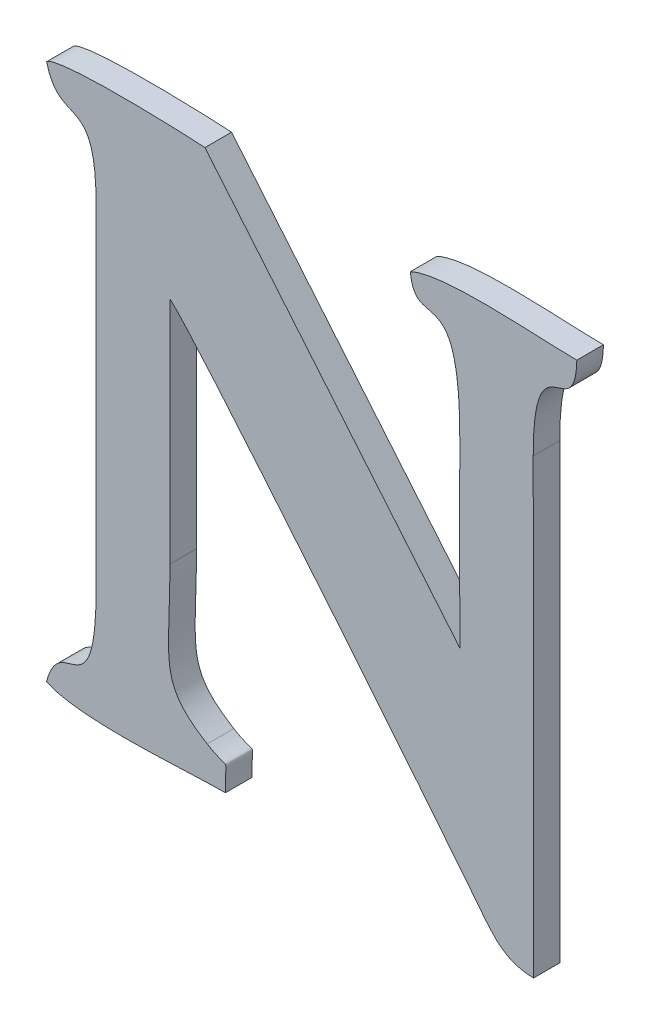
ISO-10303-21;
HEADER;
FILE_DESCRIPTION(('STEP AP214'),'2;1');
FILE_NAME('part.step','',(''),(''),'','','');
FILE_SCHEMA(('AUTOMOTIVE_DESIGN { 1 0 10303 214 1 1 1 1 }'));
ENDSEC;
DATA;
#1=APPLICATION_CONTEXT('core data for automotive mechanical design processes');
#2=APPLICATION_PROTOCOL_DEFINITION('international standard','automotive_design',2000,#1);
#3=PRODUCT_CONTEXT('',#1,'mechanical');
#4=PRODUCT('Part','Part','',(#3));
#5=PRODUCT_RELATED_PRODUCT_CATEGORY('part','',(#4));
#6=PRODUCT_DEFINITION_FORMATION('','',#4);
#7=PRODUCT_DEFINITION_CONTEXT('part definition',#1,'design');
#8=PRODUCT_DEFINITION('design','',#6,#7);
#9=PRODUCT_DEFINITION_SHAPE('','',#8);
#10=(LENGTH_UNIT() NAMED_UNIT(*) SI_UNIT(.MILLI.,.METRE.));
#11=(NAMED_UNIT(*) PLANE_ANGLE_UNIT() SI_UNIT($,.RADIAN.));
#12=(NAMED_UNIT(*) SI_UNIT($,.STERADIAN.) SOLID_ANGLE_UNIT());
#13=UNCERTAINTY_MEASURE_WITH_UNIT(LENGTH_MEASURE(1.E-05),#10,'distance_accuracy_value','');
#14=(GEOMETRIC_REPRESENTATION_CONTEXT(3) GLOBAL_UNCERTAINTY_ASSIGNED_CONTEXT((#13)) GLOBAL_UNIT_ASSIGNED_CONTEXT((#10,
#11,#12)) REPRESENTATION_CONTEXT('',''));
#15=CARTESIAN_POINT('',(0.,0.,0.));
#16=DIRECTION('',(0.,0.,1.));
#17=DIRECTION('',(1.,0.,0.));
#18=AXIS2_PLACEMENT_3D('',#15,#16,#17);
#19=CARTESIAN_POINT('',(35.1119117688146,29.2527985991207,0.001));
#20=DIRECTION('',(-0.768297979617838,-0.640092348427278,0.));
#21=DIRECTION('',(0.640092348427278,-0.768297979617838,0.));
#22=AXIS2_PLACEMENT_3D('',#19,#20,#21);
#23=PLANE('',#22);
#24=DIRECTION('',(-0.640092348427278,0.768297979617838,0.));
#25=VECTOR('',#24,1.);
#26=CARTESIAN_POINT('',(35.1119117688146,29.2527985991207,0.));
#27=LINE('',#26,#25);
#28=CARTESIAN_POINT('',(50.1452799999998,11.208361,0.));
#29=VERTEX_POINT('',#28);
#30=CARTESIAN_POINT('',(50.1357039999998,11.219855,0.));
#31=VERTEX_POINT('',#30);
#32=EDGE_CURVE('E11',#29,#31,#27,.T.);
#33=ORIENTED_EDGE('',*,*,#32,.T.);
#34=DIRECTION('',(0.,0.,-1.));
#35=VECTOR('',#34,1.);
#36=CARTESIAN_POINT('',(50.1357039999998,11.219855,0.001));
#37=LINE('',#36,#35);
#38=CARTESIAN_POINT('',(50.1357039999998,11.219855,0.001));
#39=VERTEX_POINT('',#38);
#40=EDGE_CURVE('E24',#39,#31,#37,.T.);
#41=ORIENTED_EDGE('',*,*,#40,.F.);
#42=DIRECTION('',(-0.640092348427278,0.768297979617838,0.));
#43=VECTOR('',#42,1.);
#44=CARTESIAN_POINT('',(35.1119117688146,29.2527985991207,0.001));
#45=LINE('',#44,#43);
#46=CARTESIAN_POINT('',(50.1452799999998,11.208361,0.001));
#47=VERTEX_POINT('',#46);
#48=EDGE_CURVE('E367',#47,#39,#45,.T.);
#49=ORIENTED_EDGE('',*,*,#48,.F.);
#50=DIRECTION('',(0.,0.,-1.));
#51=VECTOR('',#50,1.);
#52=CARTESIAN_POINT('',(50.1452799999998,11.208361,0.001));
#53=LINE('',#52,#51);
#54=EDGE_CURVE('E148',#47,#29,#53,.T.);
#55=ORIENTED_EDGE('',*,*,#54,.T.);
#56=EDGE_LOOP('',(#33,#41,#49,#55));
#57=FACE_BOUND('',#56,.T.);
#58=ADVANCED_FACE('F17',(#57),#23,.F.);
#59=CARTESIAN_POINT('',(50.1357039999998,11.219855,0.001));
#60=CARTESIAN_POINT('',(50.1357039999998,11.219855,0.));
#61=CARTESIAN_POINT('',(50.1347799999998,11.219925,0.001));
#62=CARTESIAN_POINT('',(50.1347799999998,11.219925,0.));
#63=CARTESIAN_POINT('',(50.1301879999998,11.220093,0.001));
#64=CARTESIAN_POINT('',(50.1301879999998,11.220093,0.));
#65=CARTESIAN_POINT('',(50.1297539999998,11.219673,0.001));
#66=CARTESIAN_POINT('',(50.1297539999998,11.219673,0.));
#67=B_SPLINE_SURFACE_WITH_KNOTS('',3,1,((#59,#60),(#61,#62),(#63,#64),(#65,#66)),.UNSPECIFIED.,
.F.,.F.,.F.,(4,4),(2,2),(0.882352941176471,1.),(0.,1.),.UNSPECIFIED.);
#68=CARTESIAN_POINT('',(50.1357039999998,11.219855,0.));
#69=CARTESIAN_POINT('',(50.1347799999998,11.219925,0.));
#70=CARTESIAN_POINT('',(50.1301879999998,11.220093,0.));
#71=CARTESIAN_POINT('',(50.1297539999998,11.219673,0.));
#72=B_SPLINE_CURVE_WITH_KNOTS('',3,(#68,#69,#70,#71),.UNSPECIFIED.,.F.,.F.,(4,4),
(0.882352941176471,1.),.UNSPECIFIED.);
#73=CARTESIAN_POINT('',(50.1297539999998,11.219673,0.));
#74=VERTEX_POINT('',#73);
#75=EDGE_CURVE('E358',#31,#74,#72,.T.);
#76=DIRECTION('',(0.,0.,-1.));
#77=VECTOR('',#76,1.);
#78=CARTESIAN_POINT('',(50.1297539999998,11.219673,0.001));
#79=LINE('',#78,#77);
#80=CARTESIAN_POINT('',(50.1297539999998,11.219673,0.001));
#81=VERTEX_POINT('',#80);
#82=EDGE_CURVE('E353',#81,#74,#79,.T.);
#83=CARTESIAN_POINT('',(50.1357039999998,11.219855,0.001));
#84=CARTESIAN_POINT('',(50.1347799999998,11.219925,0.001));
#85=CARTESIAN_POINT('',(50.1301879999998,11.220093,0.001));
#86=CARTESIAN_POINT('',(50.1297539999998,11.219673,0.001));
#87=B_SPLINE_CURVE_WITH_KNOTS('',3,(#83,#84,#85,#86),.UNSPECIFIED.,.F.,.F.,(4,4),
(0.882352941176471,1.),.UNSPECIFIED.);
#88=EDGE_CURVE('E346',#39,#81,#87,.T.);
#89=ORIENTED_EDGE('',*,*,#75,.T.);
#90=ORIENTED_EDGE('',*,*,#82,.F.);
#91=ORIENTED_EDGE('',*,*,#88,.F.);
#92=ORIENTED_EDGE('',*,*,#40,.T.);
#93=EDGE_LOOP('',(#89,#90,#91,#92));
#94=FACE_BOUND('',#93,.T.);
#95=ADVANCED_FACE('F370',(#94),#67,.F.);
#96=CARTESIAN_POINT('',(50.1297539999998,11.219673,0.001));
#97=CARTESIAN_POINT('',(50.1297539999998,11.219673,0.));
#98=CARTESIAN_POINT('',(50.1302719999998,11.217685,0.001));
#99=CARTESIAN_POINT('',(50.1302719999998,11.217685,0.));
#100=CARTESIAN_POINT('',(50.1316579999998,11.219715,0.001));
#101=CARTESIAN_POINT('',(50.1316579999998,11.219715,0.));
#102=CARTESIAN_POINT('',(50.1316159999998,11.215753,0.001));
#103=CARTESIAN_POINT('',(50.1316159999998,11.215753,0.));
#104=B_SPLINE_SURFACE_WITH_KNOTS('',3,1,((#96,#97),(#98,#99),(#100,#101),(#102,#103)),
.UNSPECIFIED.,.F.,.F.,.F.,(4,4),(2,2),(0.,0.0588235294117647),(0.,1.),.UNSPECIFIED.);
#105=CARTESIAN_POINT('',(50.1297539999998,11.219673,0.));
#106=CARTESIAN_POINT('',(50.1302719999998,11.217685,0.));
#107=CARTESIAN_POINT('',(50.1316579999998,11.219715,0.));
#108=CARTESIAN_POINT('',(50.1316159999998,11.215753,0.));
#109=B_SPLINE_CURVE_WITH_KNOTS('',3,(#105,#106,#107,#108),.UNSPECIFIED.,.F.,.F.,(4,4),(0.,
0.0588235294117647),.UNSPECIFIED.);
#110=CARTESIAN_POINT('',(50.1316159999998,11.215753,0.));
#111=VERTEX_POINT('',#110);
#112=EDGE_CURVE('E341',#74,#111,#109,.T.);
#113=DIRECTION('',(0.,0.,-1.));
#114=VECTOR('',#113,1.);
#115=CARTESIAN_POINT('',(50.1316159999998,11.215753,0.001));
#116=LINE('',#115,#114);
#117=CARTESIAN_POINT('',(50.1316159999998,11.215753,0.001));
#118=VERTEX_POINT('',#117);
#119=EDGE_CURVE('E336',#118,#111,#116,.T.);
#120=CARTESIAN_POINT('',(50.1297539999998,11.219673,0.001));
#121=CARTESIAN_POINT('',(50.1302719999998,11.217685,0.001));
#122=CARTESIAN_POINT('',(50.1316579999998,11.219715,0.001));
#123=CARTESIAN_POINT('',(50.1316159999998,11.215753,0.001));
#124=B_SPLINE_CURVE_WITH_KNOTS('',3,(#120,#121,#122,#123),.UNSPECIFIED.,.F.,.F.,(4,4),(0.,
0.0588235294117647),.UNSPECIFIED.);
#125=EDGE_CURVE('E332',#81,#118,#124,.T.);
#126=ORIENTED_EDGE('',*,*,#112,.T.);
#127=ORIENTED_EDGE('',*,*,#119,.F.);
#128=ORIENTED_EDGE('',*,*,#125,.F.);
#129=ORIENTED_EDGE('',*,*,#82,.T.);
#130=EDGE_LOOP('',(#126,#127,#128,#129));
#131=FACE_BOUND('',#130,.T.);
#132=ADVANCED_FACE('F378',(#131),#104,.F.);
#133=CARTESIAN_POINT('',(50.1316159999998,0.,0.001));
#134=DIRECTION('',(1.,0.,0.));
#135=DIRECTION('',(0.,0.,-1.));
#136=AXIS2_PLACEMENT_3D('',#133,#134,#135);
#137=PLANE('',#136);
#138=DIRECTION('',(0.,-1.,0.));
#139=VECTOR('',#138,1.);
#140=CARTESIAN_POINT('',(50.1316159999998,0.,0.));
#141=LINE('',#140,#139);
#142=CARTESIAN_POINT('',(50.1316159999998,11.203671,0.));
#143=VERTEX_POINT('',#142);
#144=EDGE_CURVE('E330',#111,#143,#141,.T.);
#145=ORIENTED_EDGE('',*,*,#144,.T.);
#146=DIRECTION('',(0.,0.,-1.));
#147=VECTOR('',#146,1.);
#148=CARTESIAN_POINT('',(50.1316159999998,11.203671,0.001));
#149=LINE('',#148,#147);
#150=CARTESIAN_POINT('',(50.1316159999998,11.203671,0.001));
#151=VERTEX_POINT('',#150);
#152=EDGE_CURVE('E327',#151,#143,#149,.T.);
#153=ORIENTED_EDGE('',*,*,#152,.F.);
#154=DIRECTION('',(0.,-1.,0.));
#155=VECTOR('',#154,1.);
#156=CARTESIAN_POINT('',(50.1316159999998,0.,0.001));
#157=LINE('',#156,#155);
#158=EDGE_CURVE('E321',#118,#151,#157,.T.);
#159=ORIENTED_EDGE('',*,*,#158,.F.);
#160=ORIENTED_EDGE('',*,*,#119,.T.);
#161=EDGE_LOOP('',(#145,#153,#159,#160));
#162=FACE_BOUND('',#161,.T.);
#163=ADVANCED_FACE('F427',(#162),#137,.F.);
#164=CARTESIAN_POINT('',(50.1316159999998,11.203671,0.001));
#165=CARTESIAN_POINT('',(50.1316159999998,11.203671,0.));
#166=CARTESIAN_POINT('',(50.1316579999998,11.198995,0.001));
#167=CARTESIAN_POINT('',(50.1316579999998,11.198995,0.));
#168=CARTESIAN_POINT('',(50.1302999999998,11.201613,0.001));
#169=CARTESIAN_POINT('',(50.1302999999998,11.201613,0.));
#170=CARTESIAN_POINT('',(50.1297539999998,11.199499,0.001));
#171=CARTESIAN_POINT('',(50.1297539999998,11.199499,0.));
#172=B_SPLINE_SURFACE_WITH_KNOTS('',3,1,((#164,#165),(#166,#167),(#168,#169),(#170,#171)),
.UNSPECIFIED.,.F.,.F.,.F.,(4,4),(2,2),(0.117647058823529,0.176470588235294),(0.,1.),.UNSPECIFIED.);
#173=CARTESIAN_POINT('',(50.1316159999998,11.203671,0.));
#174=CARTESIAN_POINT('',(50.1316579999998,11.198995,0.));
#175=CARTESIAN_POINT('',(50.1302999999998,11.201613,0.));
#176=CARTESIAN_POINT('',(50.1297539999998,11.199499,0.));
#177=B_SPLINE_CURVE_WITH_KNOTS('',3,(#173,#174,#175,#176),.UNSPECIFIED.,.F.,.F.,(4,4),
(0.117647058823529,0.176470588235294),.UNSPECIFIED.);
#178=CARTESIAN_POINT('',(50.1297539999998,11.199499,0.));
#179=VERTEX_POINT('',#178);
#180=EDGE_CURVE('E316',#143,#179,#177,.T.);
#181=DIRECTION('',(0.,0.,-1.));
#182=VECTOR('',#181,1.);
#183=CARTESIAN_POINT('',(50.1297539999998,11.199499,0.001));
#184=LINE('',#183,#182);
#185=CARTESIAN_POINT('',(50.1297539999998,11.199499,0.001));
#186=VERTEX_POINT('',#185);
#187=EDGE_CURVE('E311',#186,#179,#184,.T.);
#188=CARTESIAN_POINT('',(50.1316159999998,11.203671,0.001));
#189=CARTESIAN_POINT('',(50.1316579999998,11.198995,0.001));
#190=CARTESIAN_POINT('',(50.1302999999998,11.201613,0.001));
#191=CARTESIAN_POINT('',(50.1297539999998,11.199499,0.001));
#192=B_SPLINE_CURVE_WITH_KNOTS('',3,(#188,#189,#190,#191),.UNSPECIFIED.,.F.,.F.,(4,4),
(0.117647058823529,0.176470588235294),.UNSPECIFIED.);
#193=EDGE_CURVE('E304',#151,#186,#192,.T.);
#194=ORIENTED_EDGE('',*,*,#180,.T.);
#195=ORIENTED_EDGE('',*,*,#187,.F.);
#196=ORIENTED_EDGE('',*,*,#193,.F.);
#197=ORIENTED_EDGE('',*,*,#152,.T.);
#198=EDGE_LOOP('',(#194,#195,#196,#197));
#199=FACE_BOUND('',#198,.T.);
#200=ADVANCED_FACE('F425',(#199),#172,.F.);
#201=CARTESIAN_POINT('',(50.1297539999998,11.199499,0.001));
#202=CARTESIAN_POINT('',(50.1297539999998,11.199499,0.));
#203=CARTESIAN_POINT('',(50.1310279999998,11.198883,0.001));
#204=CARTESIAN_POINT('',(50.1310279999998,11.198883,0.));
#205=CARTESIAN_POINT('',(50.1348639999998,11.199247,0.001));
#206=CARTESIAN_POINT('',(50.1348639999998,11.199247,0.));
#207=CARTESIAN_POINT('',(50.1364739999998,11.199247,0.001));
#208=CARTESIAN_POINT('',(50.1364739999998,11.199247,0.));
#209=B_SPLINE_SURFACE_WITH_KNOTS('',3,1,((#201,#202),(#203,#204),(#205,#206),(#207,#208)),
.UNSPECIFIED.,.F.,.F.,.F.,(4,4),(2,2),(0.176470588235294,0.235294117647059),(0.,1.),.UNSPECIFIED.);
#210=CARTESIAN_POINT('',(50.1297539999998,11.199499,0.));
#211=CARTESIAN_POINT('',(50.1310279999998,11.198883,0.));
#212=CARTESIAN_POINT('',(50.1348639999998,11.199247,0.));
#213=CARTESIAN_POINT('',(50.1364739999998,11.199247,0.));
#214=B_SPLINE_CURVE_WITH_KNOTS('',3,(#210,#211,#212,#213),.UNSPECIFIED.,.F.,.F.,(4,4),
(0.176470588235294,0.235294117647059),.UNSPECIFIED.);
#215=CARTESIAN_POINT('',(50.1364739999998,11.199247,0.));
#216=VERTEX_POINT('',#215);
#217=EDGE_CURVE('E299',#179,#216,#214,.T.);
#218=DIRECTION('',(0.,0.,-1.));
#219=VECTOR('',#218,1.);
#220=CARTESIAN_POINT('',(50.1364739999998,11.199247,0.001));
#221=LINE('',#220,#219);
#222=CARTESIAN_POINT('',(50.1364739999998,11.199247,0.001));
#223=VERTEX_POINT('',#222);
#224=EDGE_CURVE('E294',#223,#216,#221,.T.);
#225=CARTESIAN_POINT('',(50.1297539999998,11.199499,0.001));
#226=CARTESIAN_POINT('',(50.1310279999998,11.198883,0.001));
#227=CARTESIAN_POINT('',(50.1348639999998,11.199247,0.001));
#228=CARTESIAN_POINT('',(50.1364739999998,11.199247,0.001));
#229=B_SPLINE_CURVE_WITH_KNOTS('',3,(#225,#226,#227,#228),.UNSPECIFIED.,.F.,.F.,(4,4),
(0.176470588235294,0.235294117647059),.UNSPECIFIED.);
#230=EDGE_CURVE('E287',#186,#223,#229,.T.);
#231=ORIENTED_EDGE('',*,*,#217,.T.);
#232=ORIENTED_EDGE('',*,*,#224,.F.);
#233=ORIENTED_EDGE('',*,*,#230,.F.);
#234=ORIENTED_EDGE('',*,*,#187,.T.);
#235=EDGE_LOOP('',(#231,#232,#233,#234));
#236=FACE_BOUND('',#235,.T.);
#237=ADVANCED_FACE('F422',(#236),#209,.F.);
#238=CARTESIAN_POINT('',(50.1364739999998,11.199247,0.001));
#239=CARTESIAN_POINT('',(50.1364739999998,11.199247,0.));
#240=CARTESIAN_POINT('',(50.1364459999998,11.200605,0.001));
#241=CARTESIAN_POINT('',(50.1364459999998,11.200605,0.));
#242=CARTESIAN_POINT('',(50.1367399999998,11.199919,0.001));
#243=CARTESIAN_POINT('',(50.1367399999998,11.199919,0.));
#244=CARTESIAN_POINT('',(50.1357879999998,11.200493,0.001));
#245=CARTESIAN_POINT('',(50.1357879999998,11.200493,0.));
#246=B_SPLINE_SURFACE_WITH_KNOTS('',3,1,((#238,#239),(#240,#241),(#242,#243),(#244,#245)),
.UNSPECIFIED.,.F.,.F.,.F.,(4,4),(2,2),(0.235294117647059,0.294117647058823),(0.,1.),.UNSPECIFIED.);
#247=CARTESIAN_POINT('',(50.1364739999998,11.199247,0.));
#248=CARTESIAN_POINT('',(50.1364459999998,11.200605,0.));
#249=CARTESIAN_POINT('',(50.1367399999998,11.199919,0.));
#250=CARTESIAN_POINT('',(50.1357879999998,11.200493,0.));
#251=B_SPLINE_CURVE_WITH_KNOTS('',3,(#247,#248,#249,#250),.UNSPECIFIED.,.F.,.F.,(4,4),
(0.235294117647059,0.294117647058823),.UNSPECIFIED.);
#252=CARTESIAN_POINT('',(50.1357879999998,11.200493,0.));
#253=VERTEX_POINT('',#252);
#254=EDGE_CURVE('E282',#216,#253,#251,.T.);
#255=DIRECTION('',(0.,0.,-1.));
#256=VECTOR('',#255,1.);
#257=CARTESIAN_POINT('',(50.1357879999998,11.200493,0.001));
#258=LINE('',#257,#256);
#259=CARTESIAN_POINT('',(50.1357879999998,11.200493,0.001));
#260=VERTEX_POINT('',#259);
#261=EDGE_CURVE('E277',#260,#253,#258,.T.);
#262=CARTESIAN_POINT('',(50.1364739999998,11.199247,0.001));
#263=CARTESIAN_POINT('',(50.1364459999998,11.200605,0.001));
#264=CARTESIAN_POINT('',(50.1367399999998,11.199919,0.001));
#265=CARTESIAN_POINT('',(50.1357879999998,11.200493,0.001));
#266=B_SPLINE_CURVE_WITH_KNOTS('',3,(#262,#263,#264,#265),.UNSPECIFIED.,.F.,.F.,(4,4),
(0.235294117647059,0.294117647058823),.UNSPECIFIED.);
#267=EDGE_CURVE('E270',#223,#260,#266,.T.);
#268=ORIENTED_EDGE('',*,*,#254,.T.);
#269=ORIENTED_EDGE('',*,*,#261,.F.);
#270=ORIENTED_EDGE('',*,*,#267,.F.);
#271=ORIENTED_EDGE('',*,*,#224,.T.);
#272=EDGE_LOOP('',(#268,#269,#270,#271));
#273=FACE_BOUND('',#272,.T.);
#274=ADVANCED_FACE('F418',(#273),#246,.F.);
#275=CARTESIAN_POINT('',(50.1357879999998,11.200493,0.001));
#276=CARTESIAN_POINT('',(50.1357879999998,11.200493,0.));
#277=CARTESIAN_POINT('',(50.1339119999998,11.201641,0.001));
#278=CARTESIAN_POINT('',(50.1339119999998,11.201641,0.));
#279=CARTESIAN_POINT('',(50.1343879999998,11.202425,0.001));
#280=CARTESIAN_POINT('',(50.1343879999998,11.202425,0.));
#281=CARTESIAN_POINT('',(50.1343879999998,11.205645,0.001));
#282=CARTESIAN_POINT('',(50.1343879999998,11.205645,0.));
#283=B_SPLINE_SURFACE_WITH_KNOTS('',3,1,((#275,#276),(#277,#278),(#279,#280),(#281,#282)),
.UNSPECIFIED.,.F.,.F.,.F.,(4,4),(2,2),(0.294117647058823,0.352941176470588),(0.,1.),.UNSPECIFIED.);
#284=CARTESIAN_POINT('',(50.1357879999998,11.200493,0.));
#285=CARTESIAN_POINT('',(50.1339119999998,11.201641,0.));
#286=CARTESIAN_POINT('',(50.1343879999998,11.202425,0.));
#287=CARTESIAN_POINT('',(50.1343879999998,11.205645,0.));
#288=B_SPLINE_CURVE_WITH_KNOTS('',3,(#284,#285,#286,#287),.UNSPECIFIED.,.F.,.F.,(4,4),
(0.294117647058823,0.352941176470588),.UNSPECIFIED.);
#289=CARTESIAN_POINT('',(50.1343879999998,11.205645,0.));
#290=VERTEX_POINT('',#289);
#291=EDGE_CURVE('E265',#253,#290,#288,.T.);
#292=DIRECTION('',(0.,0.,-1.));
#293=VECTOR('',#292,1.);
#294=CARTESIAN_POINT('',(50.1343879999998,11.205645,0.001));
#295=LINE('',#294,#293);
#296=CARTESIAN_POINT('',(50.1343879999998,11.205645,0.001));
#297=VERTEX_POINT('',#296);
#298=EDGE_CURVE('E260',#297,#290,#295,.T.);
#299=CARTESIAN_POINT('',(50.1357879999998,11.200493,0.001));
#300=CARTESIAN_POINT('',(50.1339119999998,11.201641,0.001));
#301=CARTESIAN_POINT('',(50.1343879999998,11.202425,0.001));
#302=CARTESIAN_POINT('',(50.1343879999998,11.205645,0.001));
#303=B_SPLINE_CURVE_WITH_KNOTS('',3,(#299,#300,#301,#302),.UNSPECIFIED.,.F.,.F.,(4,4),
(0.294117647058823,0.352941176470588),.UNSPECIFIED.);
#304=EDGE_CURVE('E256',#260,#297,#303,.T.);
#305=ORIENTED_EDGE('',*,*,#291,.T.);
#306=ORIENTED_EDGE('',*,*,#298,.F.);
#307=ORIENTED_EDGE('',*,*,#304,.F.);
#308=ORIENTED_EDGE('',*,*,#261,.T.);
#309=EDGE_LOOP('',(#305,#306,#307,#308));
#310=FACE_BOUND('',#309,.T.);
#311=ADVANCED_FACE('F414',(#310),#283,.F.);
#312=CARTESIAN_POINT('',(50.1343879999998,0.,0.001));
#313=DIRECTION('',(-1.,0.,0.));
#314=DIRECTION('',(0.,0.,1.));
#315=AXIS2_PLACEMENT_3D('',#312,#313,#314);
#316=PLANE('',#315);
#317=DIRECTION('',(0.,1.,0.));
#318=VECTOR('',#317,1.);
#319=CARTESIAN_POINT('',(50.1343879999998,0.,0.));
#320=LINE('',#319,#318);
#321=CARTESIAN_POINT('',(50.1343879999998,11.214269,0.));
#322=VERTEX_POINT('',#321);
#323=EDGE_CURVE('E254',#290,#322,#320,.T.);
#324=ORIENTED_EDGE('',*,*,#323,.T.);
#325=DIRECTION('',(0.,0.,-1.));
#326=VECTOR('',#325,1.);
#327=CARTESIAN_POINT('',(50.1343879999998,11.214269,0.001));
#328=LINE('',#327,#326);
#329=CARTESIAN_POINT('',(50.1343879999998,11.214269,0.001));
#330=VERTEX_POINT('',#329);
#331=EDGE_CURVE('E251',#330,#322,#328,.T.);
#332=ORIENTED_EDGE('',*,*,#331,.F.);
#333=DIRECTION('',(0.,1.,0.));
#334=VECTOR('',#333,1.);
#335=CARTESIAN_POINT('',(50.1343879999998,0.,0.001));
#336=LINE('',#335,#334);
#337=EDGE_CURVE('E245',#297,#330,#336,.T.);
#338=ORIENTED_EDGE('',*,*,#337,.F.);
#339=ORIENTED_EDGE('',*,*,#298,.T.);
#340=EDGE_LOOP('',(#324,#332,#338,#339));
#341=FACE_BOUND('',#340,.T.);
#342=ADVANCED_FACE('F408',(#341),#316,.F.);
#343=CARTESIAN_POINT('',(50.1343879999998,11.214269,0.000999999999999998));
#344=CARTESIAN_POINT('',(50.1343879999998,11.214269,0.));
#345=CARTESIAN_POINT('',(50.1351579999998,11.213723,0.000999999999999998));
#346=CARTESIAN_POINT('',(50.1351579999998,11.213723,0.));
#347=CARTESIAN_POINT('',(50.1439359999998,11.202943,0.000999999999999998));
#348=CARTESIAN_POINT('',(50.1439359999998,11.202943,0.));
#349=CARTESIAN_POINT('',(50.1458119999998,11.200549,0.000999999999999998));
#350=CARTESIAN_POINT('',(50.1458119999998,11.200549,0.));
#351=B_SPLINE_SURFACE_WITH_KNOTS('',3,1,((#343,#344),(#345,#346),(#347,#348),(#349,#350)),
.UNSPECIFIED.,.F.,.F.,.F.,(4,4),(2,2),(0.411764705882353,0.470588235294118),(0.,1.),.UNSPECIFIED.);
#352=CARTESIAN_POINT('',(50.1343879999998,11.214269,0.));
#353=CARTESIAN_POINT('',(50.1351579999998,11.213723,0.));
#354=CARTESIAN_POINT('',(50.1439359999998,11.202943,0.));
#355=CARTESIAN_POINT('',(50.1458119999998,11.200549,0.));
#356=B_SPLINE_CURVE_WITH_KNOTS('',3,(#352,#353,#354,#355),.UNSPECIFIED.,.F.,.F.,(4,4),
(0.411764705882353,0.470588235294118),.UNSPECIFIED.);
#357=CARTESIAN_POINT('',(50.1458119999998,11.200549,0.));
#358=VERTEX_POINT('',#357);
#359=EDGE_CURVE('E240',#322,#358,#356,.T.);
#360=DIRECTION('',(0.,0.,-1.));
#361=VECTOR('',#360,1.);
#362=CARTESIAN_POINT('',(50.1458119999998,11.200549,0.000999999999999998));
#363=LINE('',#362,#361);
#364=CARTESIAN_POINT('',(50.1458119999998,11.200549,0.000999999999999998));
#365=VERTEX_POINT('',#364);
#366=EDGE_CURVE('E235',#365,#358,#363,.T.);
#367=CARTESIAN_POINT('',(50.1343879999998,11.214269,0.001));
#368=CARTESIAN_POINT('',(50.1351579999998,11.213723,0.000999999999999998));
#369=CARTESIAN_POINT('',(50.1439359999998,11.202943,0.000999999999999998));
#370=CARTESIAN_POINT('',(50.1458119999998,11.200549,0.000999999999999998));
#371=B_SPLINE_CURVE_WITH_KNOTS('',3,(#367,#368,#369,#370),.UNSPECIFIED.,.F.,.F.,(4,4),
(0.411764705882353,0.470588235294118),.UNSPECIFIED.);
#372=EDGE_CURVE('E228',#330,#365,#371,.T.);
#373=ORIENTED_EDGE('',*,*,#359,.T.);
#374=ORIENTED_EDGE('',*,*,#366,.F.);
#375=ORIENTED_EDGE('',*,*,#372,.F.);
#376=ORIENTED_EDGE('',*,*,#331,.T.);
#377=EDGE_LOOP('',(#373,#374,#375,#376));
#378=FACE_BOUND('',#377,.T.);
#379=ADVANCED_FACE('F405',(#378),#351,.F.);
#380=CARTESIAN_POINT('',(50.1458119999998,11.200549,0.001));
#381=CARTESIAN_POINT('',(50.1458119999998,11.200549,0.));
#382=CARTESIAN_POINT('',(50.1465259999998,11.199639,0.001));
#383=CARTESIAN_POINT('',(50.1465259999998,11.199639,0.));
#384=CARTESIAN_POINT('',(50.1469179999998,11.199023,0.001));
#385=CARTESIAN_POINT('',(50.1469179999998,11.199023,0.));
#386=CARTESIAN_POINT('',(50.1480519999998,11.199009,0.001));
#387=CARTESIAN_POINT('',(50.1480519999998,11.199009,0.));
#388=B_SPLINE_SURFACE_WITH_KNOTS('',3,1,((#380,#381),(#382,#383),(#384,#385),(#386,#387)),
.UNSPECIFIED.,.F.,.F.,.F.,(4,4),(2,2),(0.470588235294118,0.529411764705882),(0.,1.),.UNSPECIFIED.);
#389=CARTESIAN_POINT('',(50.1458119999998,11.200549,0.));
#390=CARTESIAN_POINT('',(50.1465259999998,11.199639,0.));
#391=CARTESIAN_POINT('',(50.1469179999998,11.199023,0.));
#392=CARTESIAN_POINT('',(50.1480519999998,11.199009,0.));
#393=B_SPLINE_CURVE_WITH_KNOTS('',3,(#389,#390,#391,#392),.UNSPECIFIED.,.F.,.F.,(4,4),
(0.470588235294118,0.529411764705882),.UNSPECIFIED.);
#394=CARTESIAN_POINT('',(50.1480519999998,11.199009,0.));
#395=VERTEX_POINT('',#394);
#396=EDGE_CURVE('E223',#358,#395,#393,.T.);
#397=DIRECTION('',(0.,0.,-1.));
#398=VECTOR('',#397,1.);
#399=CARTESIAN_POINT('',(50.1480519999998,11.199009,0.001));
#400=LINE('',#399,#398);
#401=CARTESIAN_POINT('',(50.1480519999998,11.199009,0.001));
#402=VERTEX_POINT('',#401);
#403=EDGE_CURVE('E218',#402,#395,#400,.T.);
#404=CARTESIAN_POINT('',(50.1458119999998,11.200549,0.000999999999999998));
#405=CARTESIAN_POINT('',(50.1465259999998,11.199639,0.001));
#406=CARTESIAN_POINT('',(50.1469179999998,11.199023,0.001));
#407=CARTESIAN_POINT('',(50.1480519999998,11.199009,0.001));
#408=B_SPLINE_CURVE_WITH_KNOTS('',3,(#404,#405,#406,#407),.UNSPECIFIED.,.F.,.F.,(4,4),
(0.470588235294118,0.529411764705882),.UNSPECIFIED.);
#409=EDGE_CURVE('E214',#365,#402,#408,.T.);
#410=ORIENTED_EDGE('',*,*,#396,.T.);
#411=ORIENTED_EDGE('',*,*,#403,.F.);
#412=ORIENTED_EDGE('',*,*,#409,.F.);
#413=ORIENTED_EDGE('',*,*,#366,.T.);
#414=EDGE_LOOP('',(#410,#411,#412,#413));
#415=FACE_BOUND('',#414,.T.);
#416=ADVANCED_FACE('F399',(#415),#388,.F.);
#417=CARTESIAN_POINT('',(50.1572504000428,0.0413497530283183,0.001));
#418=DIRECTION('',(-0.99999966018059,-0.000824402028561643,0.));
#419=DIRECTION('',(0.000824402028561643,-0.99999966018059,0.));
#420=AXIS2_PLACEMENT_3D('',#417,#418,#419);
#421=PLANE('',#420);
#422=DIRECTION('',(-0.000824402028561643,0.99999966018059,0.));
#423=VECTOR('',#422,1.);
#424=CARTESIAN_POINT('',(50.1572504000428,0.0413497530283183,0.));
#425=LINE('',#424,#423);
#426=CARTESIAN_POINT('',(50.1480379999998,11.215991,0.));
#427=VERTEX_POINT('',#426);
#428=EDGE_CURVE('E212',#395,#427,#425,.T.);
#429=ORIENTED_EDGE('',*,*,#428,.T.);
#430=DIRECTION('',(0.,0.,-1.));
#431=VECTOR('',#430,1.);
#432=CARTESIAN_POINT('',(50.1480379999998,11.215991,0.001));
#433=LINE('',#432,#431);
#434=CARTESIAN_POINT('',(50.1480379999998,11.215991,0.001));
#435=VERTEX_POINT('',#434);
#436=EDGE_CURVE('E209',#435,#427,#433,.T.);
#437=ORIENTED_EDGE('',*,*,#436,.F.);
#438=DIRECTION('',(-0.000824402028561643,0.99999966018059,0.));
#439=VECTOR('',#438,1.);
#440=CARTESIAN_POINT('',(50.1572504000428,0.0413497530283183,0.001));
#441=LINE('',#440,#439);
#442=EDGE_CURVE('E203',#402,#435,#441,.T.);
#443=ORIENTED_EDGE('',*,*,#442,.F.);
#444=ORIENTED_EDGE('',*,*,#403,.T.);
#445=EDGE_LOOP('',(#429,#437,#443,#444));
#446=FACE_BOUND('',#445,.T.);
#447=ADVANCED_FACE('F393',(#446),#421,.F.);
#448=CARTESIAN_POINT('',(50.1480379999998,11.215991,0.001));
#449=CARTESIAN_POINT('',(50.1480379999998,11.215991,0.));
#450=CARTESIAN_POINT('',(50.1480239999998,11.220177,0.001));
#451=CARTESIAN_POINT('',(50.1480239999998,11.220177,0.));
#452=CARTESIAN_POINT('',(50.1496199999998,11.217517,0.001));
#453=CARTESIAN_POINT('',(50.1496199999998,11.217517,0.));
#454=CARTESIAN_POINT('',(50.1496759999998,11.219925,0.001));
#455=CARTESIAN_POINT('',(50.1496759999998,11.219925,0.));
#456=B_SPLINE_SURFACE_WITH_KNOTS('',3,1,((#448,#449),(#450,#451),(#452,#453),(#454,#455)),
.UNSPECIFIED.,.F.,.F.,.F.,(4,4),(2,2),(0.588235294117647,0.647058823529412),(0.,1.),.UNSPECIFIED.);
#457=CARTESIAN_POINT('',(50.1480379999998,11.215991,0.));
#458=CARTESIAN_POINT('',(50.1480239999998,11.220177,0.));
#459=CARTESIAN_POINT('',(50.1496199999998,11.217517,0.));
#460=CARTESIAN_POINT('',(50.1496759999998,11.219925,0.));
#461=B_SPLINE_CURVE_WITH_KNOTS('',3,(#457,#458,#459,#460),.UNSPECIFIED.,.F.,.F.,(4,4),
(0.588235294117647,0.647058823529412),.UNSPECIFIED.);
#462=CARTESIAN_POINT('',(50.1496759999998,11.219925,0.));
#463=VERTEX_POINT('',#462);
#464=EDGE_CURVE('E198',#427,#463,#461,.T.);
#465=DIRECTION('',(0.,0.,-1.));
#466=VECTOR('',#465,1.);
#467=CARTESIAN_POINT('',(50.1496759999998,11.219925,0.001));
#468=LINE('',#467,#466);
#469=CARTESIAN_POINT('',(50.1496759999998,11.219925,0.001));
#470=VERTEX_POINT('',#469);
#471=EDGE_CURVE('E193',#470,#463,#468,.T.);
#472=CARTESIAN_POINT('',(50.1480379999998,11.215991,0.001));
#473=CARTESIAN_POINT('',(50.1480239999998,11.220177,0.001));
#474=CARTESIAN_POINT('',(50.1496199999998,11.217517,0.001));
#475=CARTESIAN_POINT('',(50.1496759999998,11.219925,0.001));
#476=B_SPLINE_CURVE_WITH_KNOTS('',3,(#472,#473,#474,#475),.UNSPECIFIED.,.F.,.F.,(4,4),
(0.588235294117647,0.647058823529412),.UNSPECIFIED.);
#477=EDGE_CURVE('E186',#435,#470,#476,.T.);
#478=ORIENTED_EDGE('',*,*,#464,.T.);
#479=ORIENTED_EDGE('',*,*,#471,.F.);
#480=ORIENTED_EDGE('',*,*,#477,.F.);
#481=ORIENTED_EDGE('',*,*,#436,.T.);
#482=EDGE_LOOP('',(#478,#479,#480,#481));
#483=FACE_BOUND('',#482,.T.);
#484=ADVANCED_FACE('F390',(#483),#456,.F.);
#485=CARTESIAN_POINT('',(50.1496759999998,11.219925,0.001));
#486=CARTESIAN_POINT('',(50.1496759999998,11.219925,0.));
#487=CARTESIAN_POINT('',(50.1481499999998,11.219925,0.001));
#488=CARTESIAN_POINT('',(50.1481499999998,11.219925,0.));
#489=CARTESIAN_POINT('',(50.1446359999998,11.220275,0.001));
#490=CARTESIAN_POINT('',(50.1446359999998,11.220275,0.));
#491=CARTESIAN_POINT('',(50.1434179999998,11.219673,0.001));
#492=CARTESIAN_POINT('',(50.1434179999998,11.219673,0.));
#493=B_SPLINE_SURFACE_WITH_KNOTS('',3,1,((#485,#486),(#487,#488),(#489,#490),(#491,#492)),
.UNSPECIFIED.,.F.,.F.,.F.,(4,4),(2,2),(0.647058823529412,0.705882352941177),(0.,1.),.UNSPECIFIED.);
#494=CARTESIAN_POINT('',(50.1496759999998,11.219925,0.));
#495=CARTESIAN_POINT('',(50.1481499999998,11.219925,0.));
#496=CARTESIAN_POINT('',(50.1446359999998,11.220275,0.));
#497=CARTESIAN_POINT('',(50.1434179999998,11.219673,0.));
#498=B_SPLINE_CURVE_WITH_KNOTS('',3,(#494,#495,#496,#497),.UNSPECIFIED.,.F.,.F.,(4,4),
(0.647058823529412,0.705882352941177),.UNSPECIFIED.);
#499=CARTESIAN_POINT('',(50.1434179999998,11.219673,0.));
#500=VERTEX_POINT('',#499);
#501=EDGE_CURVE('E181',#463,#500,#498,.T.);
#502=DIRECTION('',(0.,0.,-1.));
#503=VECTOR('',#502,1.);
#504=CARTESIAN_POINT('',(50.1434179999998,11.219673,0.001));
#505=LINE('',#504,#503);
#506=CARTESIAN_POINT('',(50.1434179999998,11.219673,0.001));
#507=VERTEX_POINT('',#506);
#508=EDGE_CURVE('E176',#507,#500,#505,.T.);
#509=CARTESIAN_POINT('',(50.1496759999998,11.219925,0.001));
#510=CARTESIAN_POINT('',(50.1481499999998,11.219925,0.001));
#511=CARTESIAN_POINT('',(50.1446359999998,11.220275,0.001));
#512=CARTESIAN_POINT('',(50.1434179999998,11.219673,0.001));
#513=B_SPLINE_CURVE_WITH_KNOTS('',3,(#509,#510,#511,#512),.UNSPECIFIED.,.F.,.F.,(4,4),
(0.647058823529412,0.705882352941177),.UNSPECIFIED.);
#514=EDGE_CURVE('E133',#470,#507,#513,.T.);
#515=ORIENTED_EDGE('',*,*,#501,.T.);
#516=ORIENTED_EDGE('',*,*,#508,.F.);
#517=ORIENTED_EDGE('',*,*,#514,.F.);
#518=ORIENTED_EDGE('',*,*,#471,.T.);
#519=EDGE_LOOP('',(#515,#516,#517,#518));
#520=FACE_BOUND('',#519,.T.);
#521=ADVANCED_FACE('F386',(#520),#493,.F.);
#522=CARTESIAN_POINT('',(50.1434179999998,11.219673,0.000999999999999998));
#523=CARTESIAN_POINT('',(50.1434179999998,11.219673,0.));
#524=CARTESIAN_POINT('',(50.1436419999998,11.217685,0.000999999999999998));
#525=CARTESIAN_POINT('',(50.1436419999998,11.217685,0.));
#526=CARTESIAN_POINT('',(50.1453219999998,11.220541,0.000999999999999998));
#527=CARTESIAN_POINT('',(50.1453219999998,11.220541,0.));
#528=CARTESIAN_POINT('',(50.1452799999998,11.215011,0.000999999999999998));
#529=CARTESIAN_POINT('',(50.1452799999998,11.215011,0.));
#530=B_SPLINE_SURFACE_WITH_KNOTS('',3,1,((#522,#523),(#524,#525),(#526,#527),(#528,#529)),
.UNSPECIFIED.,.F.,.F.,.F.,(4,4),(2,2),(0.705882352941177,0.764705882352941),(0.,1.),.UNSPECIFIED.);
#531=CARTESIAN_POINT('',(50.1434179999998,11.219673,0.));
#532=CARTESIAN_POINT('',(50.1436419999998,11.217685,0.));
#533=CARTESIAN_POINT('',(50.1453219999998,11.220541,0.));
#534=CARTESIAN_POINT('',(50.1452799999998,11.215011,0.));
#535=B_SPLINE_CURVE_WITH_KNOTS('',3,(#531,#532,#533,#534),.UNSPECIFIED.,.F.,.F.,(4,4),
(0.705882352941177,0.764705882352941),.UNSPECIFIED.);
#536=CARTESIAN_POINT('',(50.1452799999998,11.215011,0.));
#537=VERTEX_POINT('',#536);
#538=EDGE_CURVE('E142',#500,#537,#535,.T.);
#539=DIRECTION('',(0.,0.,-1.));
#540=VECTOR('',#539,1.);
#541=CARTESIAN_POINT('',(50.1452799999998,11.215011,0.000999999999999998));
#542=LINE('',#541,#540);
#543=CARTESIAN_POINT('',(50.1452799999998,11.215011,0.000999999999999998));
#544=VERTEX_POINT('',#543);
#545=EDGE_CURVE('E136',#544,#537,#542,.T.);
#546=CARTESIAN_POINT('',(50.1434179999998,11.219673,0.001));
#547=CARTESIAN_POINT('',(50.1436419999998,11.217685,0.000999999999999998));
#548=CARTESIAN_POINT('',(50.1453219999998,11.220541,0.000999999999999998));
#549=CARTESIAN_POINT('',(50.1452799999998,11.215011,0.000999999999999998));
#550=B_SPLINE_CURVE_WITH_KNOTS('',3,(#546,#547,#548,#549),.UNSPECIFIED.,.F.,.F.,(4,4),
(0.705882352941177,0.764705882352941),.UNSPECIFIED.);
#551=EDGE_CURVE('E126',#507,#544,#550,.T.);
#552=ORIENTED_EDGE('',*,*,#538,.T.);
#553=ORIENTED_EDGE('',*,*,#545,.F.);
#554=ORIENTED_EDGE('',*,*,#551,.F.);
#555=ORIENTED_EDGE('',*,*,#508,.T.);
#556=EDGE_LOOP('',(#552,#553,#554,#555));
#557=FACE_BOUND('',#556,.T.);
#558=ADVANCED_FACE('F140',(#557),#530,.F.);
#559=CARTESIAN_POINT('',(50.1452799999998,11.215011,0.001));
#560=CARTESIAN_POINT('',(50.1452799999998,11.215011,0.));
#561=CARTESIAN_POINT('',(50.1452659999998,11.212785,0.001));
#562=CARTESIAN_POINT('',(50.1452659999998,11.212785,0.));
#563=CARTESIAN_POINT('',(50.1452799999998,11.210573,0.001));
#564=CARTESIAN_POINT('',(50.1452799999998,11.210573,0.));
#565=CARTESIAN_POINT('',(50.1452799999998,11.208361,0.001));
#566=CARTESIAN_POINT('',(50.1452799999998,11.208361,0.));
#567=B_SPLINE_SURFACE_WITH_KNOTS('',3,1,((#559,#560),(#561,#562),(#563,#564),(#565,#566)),
.UNSPECIFIED.,.F.,.F.,.F.,(4,4),(2,2),(0.764705882352941,0.823529411764706),(0.,1.),.UNSPECIFIED.);
#568=CARTESIAN_POINT('',(50.1452799999998,11.215011,0.));
#569=CARTESIAN_POINT('',(50.1452659999998,11.212785,0.));
#570=CARTESIAN_POINT('',(50.1452799999998,11.210573,0.));
#571=CARTESIAN_POINT('',(50.1452799999998,11.208361,0.));
#572=B_SPLINE_CURVE_WITH_KNOTS('',3,(#568,#569,#570,#571),.UNSPECIFIED.,.F.,.F.,(4,4),
(0.764705882352941,0.823529411764706),.UNSPECIFIED.);
#573=EDGE_CURVE('E137',#537,#29,#572,.T.);
#574=CARTESIAN_POINT('',(50.1452799999998,11.215011,0.000999999999999998));
#575=CARTESIAN_POINT('',(50.1452659999998,11.212785,0.001));
#576=CARTESIAN_POINT('',(50.1452799999998,11.210573,0.001));
#577=CARTESIAN_POINT('',(50.1452799999998,11.208361,0.001));
#578=B_SPLINE_CURVE_WITH_KNOTS('',3,(#574,#575,#576,#577),.UNSPECIFIED.,.F.,.F.,(4,4),
(0.764705882352941,0.823529411764706),.UNSPECIFIED.);
#579=EDGE_CURVE('E131',#544,#47,#578,.T.);
#580=ORIENTED_EDGE('',*,*,#573,.T.);
#581=ORIENTED_EDGE('',*,*,#54,.F.);
#582=ORIENTED_EDGE('',*,*,#579,.F.);
#583=ORIENTED_EDGE('',*,*,#545,.T.);
#584=EDGE_LOOP('',(#580,#581,#582,#583));
#585=FACE_BOUND('',#584,.T.);
#586=ADVANCED_FACE('F147',(#585),#567,.F.);
#587=CARTESIAN_POINT('',(0.,0.,0.001));
#588=DIRECTION('',(0.,0.,1.));
#589=DIRECTION('',(1.,0.,0.));
#590=AXIS2_PLACEMENT_3D('',#587,#588,#589);
#591=PLANE('',#590);
#592=ORIENTED_EDGE('',*,*,#48,.T.);
#593=ORIENTED_EDGE('',*,*,#88,.T.);
#594=ORIENTED_EDGE('',*,*,#125,.T.);
#595=ORIENTED_EDGE('',*,*,#158,.T.);
#596=ORIENTED_EDGE('',*,*,#193,.T.);
#597=ORIENTED_EDGE('',*,*,#230,.T.);
#598=ORIENTED_EDGE('',*,*,#267,.T.);
#599=ORIENTED_EDGE('',*,*,#304,.T.);
#600=ORIENTED_EDGE('',*,*,#337,.T.);
#601=ORIENTED_EDGE('',*,*,#372,.T.);
#602=ORIENTED_EDGE('',*,*,#409,.T.);
#603=ORIENTED_EDGE('',*,*,#442,.T.);
#604=ORIENTED_EDGE('',*,*,#477,.T.);
#605=ORIENTED_EDGE('',*,*,#514,.T.);
#606=ORIENTED_EDGE('',*,*,#551,.T.);
#607=ORIENTED_EDGE('',*,*,#579,.T.);
#608=EDGE_LOOP('',(#592,#593,#594,#595,#596,#597,#598,#599,#600,#601,#602,#603,#604,#605,#606,#607));
#609=FACE_BOUND('',#608,.T.);
#610=ADVANCED_FACE('F129',(#609),#591,.T.);
#611=CARTESIAN_POINT('',(0.,0.,0.));
#612=DIRECTION('',(0.,0.,1.));
#613=DIRECTION('',(1.,0.,0.));
#614=AXIS2_PLACEMENT_3D('',#611,#612,#613);
#615=PLANE('',#614);
#616=ORIENTED_EDGE('',*,*,#32,.F.);
#617=ORIENTED_EDGE('',*,*,#573,.F.);
#618=ORIENTED_EDGE('',*,*,#538,.F.);
#619=ORIENTED_EDGE('',*,*,#501,.F.);
#620=ORIENTED_EDGE('',*,*,#464,.F.);
#621=ORIENTED_EDGE('',*,*,#428,.F.);
#622=ORIENTED_EDGE('',*,*,#396,.F.);
#623=ORIENTED_EDGE('',*,*,#359,.F.);
#624=ORIENTED_EDGE('',*,*,#323,.F.);
#625=ORIENTED_EDGE('',*,*,#291,.F.);
#626=ORIENTED_EDGE('',*,*,#254,.F.);
#627=ORIENTED_EDGE('',*,*,#217,.F.);
#628=ORIENTED_EDGE('',*,*,#180,.F.);
#629=ORIENTED_EDGE('',*,*,#144,.F.);
#630=ORIENTED_EDGE('',*,*,#112,.F.);
#631=ORIENTED_EDGE('',*,*,#75,.F.);
#632=EDGE_LOOP('',(#616,#617,#618,#619,#620,#621,#622,#623,#624,#625,#626,#627,#628,#629,#630,#631));
#633=FACE_BOUND('',#632,.T.);
#634=ADVANCED_FACE('F373',(#633),#615,.F.);
#635=CLOSED_SHELL('',(#58,#95,#132,#163,#200,#237,#274,#311,#342,#379,#416,#447,#484,#521,#558,
#586,#610,#634));
#636=MANIFOLD_SOLID_BREP('B1',#635);
#637=ADVANCED_BREP_SHAPE_REPRESENTATION('',(#18,#636),#14);
#638=SHAPE_DEFINITION_REPRESENTATION(#9,#637);
ENDSEC;
END-ISO-10303-21;
